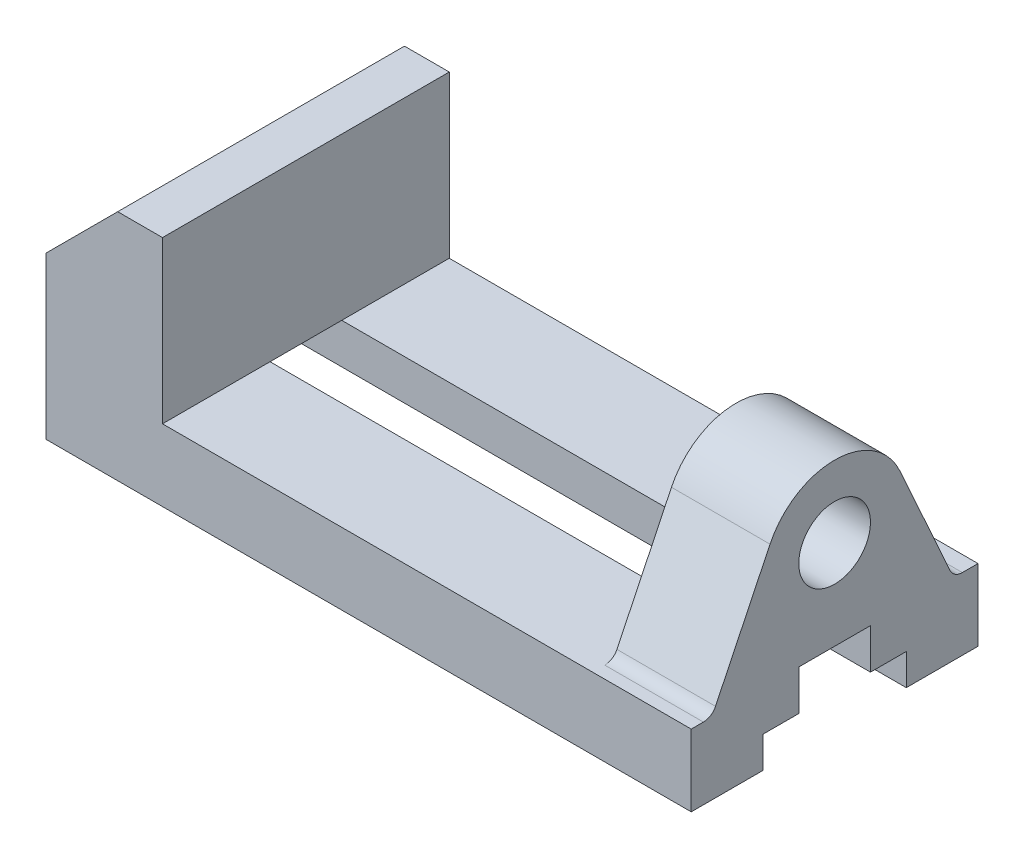
ISO-10303-21;
HEADER;
FILE_DESCRIPTION(('STEP AP214'),'2;1');
FILE_NAME('part.step','',(''),(''),'','','');
FILE_SCHEMA(('AUTOMOTIVE_DESIGN { 1 0 10303 214 1 1 1 1 }'));
ENDSEC;
DATA;
#1=APPLICATION_CONTEXT('core data for automotive mechanical design processes');
#2=APPLICATION_PROTOCOL_DEFINITION('international standard','automotive_design',2000,#1);
#3=PRODUCT_CONTEXT('',#1,'mechanical');
#4=PRODUCT('Part','Part','',(#3));
#5=PRODUCT_RELATED_PRODUCT_CATEGORY('part','',(#4));
#6=PRODUCT_DEFINITION_FORMATION('','',#4);
#7=PRODUCT_DEFINITION_CONTEXT('part definition',#1,'design');
#8=PRODUCT_DEFINITION('design','',#6,#7);
#9=PRODUCT_DEFINITION_SHAPE('','',#8);
#10=(LENGTH_UNIT() NAMED_UNIT(*) SI_UNIT(.MILLI.,.METRE.));
#11=(NAMED_UNIT(*) PLANE_ANGLE_UNIT() SI_UNIT($,.RADIAN.));
#12=(NAMED_UNIT(*) SI_UNIT($,.STERADIAN.) SOLID_ANGLE_UNIT());
#13=UNCERTAINTY_MEASURE_WITH_UNIT(LENGTH_MEASURE(1.E-05),#10,'distance_accuracy_value','');
#14=(GEOMETRIC_REPRESENTATION_CONTEXT(3) GLOBAL_UNCERTAINTY_ASSIGNED_CONTEXT((#13)) GLOBAL_UNIT_ASSIGNED_CONTEXT((#10,
#11,#12)) REPRESENTATION_CONTEXT('',''));
#15=CARTESIAN_POINT('',(0.,0.,0.));
#16=DIRECTION('',(0.,0.,1.));
#17=DIRECTION('',(1.,0.,0.));
#18=AXIS2_PLACEMENT_3D('',#15,#16,#17);
#19=CARTESIAN_POINT('',(0.,16.,0.));
#20=DIRECTION('',(0.,1.,0.));
#21=DIRECTION('',(0.,0.,1.));
#22=AXIS2_PLACEMENT_3D('',#19,#20,#21);
#23=PLANE('',#22);
#24=DIRECTION('',(0.,0.,-1.));
#25=VECTOR('',#24,1.);
#26=CARTESIAN_POINT('',(72.,16.,32.));
#27=LINE('',#26,#25);
#28=CARTESIAN_POINT('',(72.,16.,32.));
#29=VERTEX_POINT('',#28);
#30=CARTESIAN_POINT('',(72.,16.,29.2853607883685));
#31=VERTEX_POINT('',#30);
#32=EDGE_CURVE('E352',#29,#31,#27,.T.);
#33=ORIENTED_EDGE('',*,*,#32,.T.);
#34=DIRECTION('',(1.,0.,0.));
#35=VECTOR('',#34,1.);
#36=CARTESIAN_POINT('',(50.,16.,29.2853607883685));
#37=LINE('',#36,#35);
#38=CARTESIAN_POINT('',(50.,16.,29.2853607883685));
#39=VERTEX_POINT('',#38);
#40=EDGE_CURVE('E396',#31,#39,#37,.F.);
#41=ORIENTED_EDGE('',*,*,#40,.T.);
#42=DIRECTION('',(0.,0.,-1.));
#43=VECTOR('',#42,1.);
#44=CARTESIAN_POINT('',(50.,16.,27.40102070522));
#45=LINE('',#44,#43);
#46=CARTESIAN_POINT('',(50.,16.,8.00000000000001));
#47=VERTEX_POINT('',#46);
#48=EDGE_CURVE('E50',#39,#47,#45,.T.);
#49=ORIENTED_EDGE('',*,*,#48,.T.);
#50=DIRECTION('',(1.,0.,0.));
#51=VECTOR('',#50,1.);
#52=CARTESIAN_POINT('',(-72.001,16.,8.));
#53=LINE('',#52,#51);
#54=CARTESIAN_POINT('',(-46.,16.,8.));
#55=VERTEX_POINT('',#54);
#56=EDGE_CURVE('E313',#55,#47,#53,.T.);
#57=ORIENTED_EDGE('',*,*,#56,.F.);
#58=DIRECTION('',(0.,0.,1.));
#59=VECTOR('',#58,1.);
#60=CARTESIAN_POINT('',(-46.,16.,-32.));
#61=LINE('',#60,#59);
#62=CARTESIAN_POINT('',(-46.,16.,32.));
#63=VERTEX_POINT('',#62);
#64=EDGE_CURVE('E330',#55,#63,#61,.T.);
#65=ORIENTED_EDGE('',*,*,#64,.T.);
#66=DIRECTION('',(1.,0.,0.));
#67=VECTOR('',#66,1.);
#68=CARTESIAN_POINT('',(72.,16.,32.));
#69=LINE('',#68,#67);
#70=EDGE_CURVE('E348',#63,#29,#69,.T.);
#71=ORIENTED_EDGE('',*,*,#70,.T.);
#72=EDGE_LOOP('',(#33,#41,#49,#57,#65,#71));
#73=FACE_BOUND('',#72,.T.);
#74=ADVANCED_FACE('F36',(#73),#23,.T.);
#75=CARTESIAN_POINT('',(0.,0.,0.));
#76=DIRECTION('',(0.,1.,0.));
#77=DIRECTION('',(0.,0.,1.));
#78=AXIS2_PLACEMENT_3D('',#75,#76,#77);
#79=PLANE('',#78);
#80=CARTESIAN_POINT('',(-36.,0.,22.));
#81=DIRECTION('',(0.,-1.,0.));
#82=DIRECTION('',(0.,0.,-1.));
#83=AXIS2_PLACEMENT_3D('',#80,#81,#82);
#84=CIRCLE('',#83,3.12499999999999);
#85=CARTESIAN_POINT('',(-36.,0.,18.875));
#86=VERTEX_POINT('',#85);
#87=EDGE_CURVE('E212',#86,#86,#84,.T.);
#88=ORIENTED_EDGE('',*,*,#87,.F.);
#89=EDGE_LOOP('',(#88));
#90=FACE_BOUND('',#89,.T.);
#91=CARTESIAN_POINT('',(34.,0.,22.));
#92=DIRECTION('',(0.,-1.,0.));
#93=DIRECTION('',(0.,0.,-1.));
#94=AXIS2_PLACEMENT_3D('',#91,#92,#93);
#95=CIRCLE('',#94,3.12499999999999);
#96=CARTESIAN_POINT('',(34.,0.,18.875));
#97=VERTEX_POINT('',#96);
#98=EDGE_CURVE('E211',#97,#97,#95,.T.);
#99=ORIENTED_EDGE('',*,*,#98,.F.);
#100=EDGE_LOOP('',(#99));
#101=FACE_BOUND('',#100,.T.);
#102=DIRECTION('',(0.,0.,1.));
#103=VECTOR('',#102,1.);
#104=CARTESIAN_POINT('',(-72.,0.,32.));
#105=LINE('',#104,#103);
#106=CARTESIAN_POINT('',(-72.,0.,16.));
#107=VERTEX_POINT('',#106);
#108=CARTESIAN_POINT('',(-72.,0.,32.));
#109=VERTEX_POINT('',#108);
#110=EDGE_CURVE('E346',#107,#109,#105,.T.);
#111=ORIENTED_EDGE('',*,*,#110,.F.);
#112=DIRECTION('',(1.,0.,0.));
#113=VECTOR('',#112,1.);
#114=CARTESIAN_POINT('',(-72.001,0.,16.));
#115=LINE('',#114,#113);
#116=CARTESIAN_POINT('',(72.,0.,16.));
#117=VERTEX_POINT('',#116);
#118=EDGE_CURVE('E304',#107,#117,#115,.T.);
#119=ORIENTED_EDGE('',*,*,#118,.T.);
#120=DIRECTION('',(0.,0.,-1.));
#121=VECTOR('',#120,1.);
#122=CARTESIAN_POINT('',(72.,0.,32.));
#123=LINE('',#122,#121);
#124=CARTESIAN_POINT('',(72.,0.,32.));
#125=VERTEX_POINT('',#124);
#126=EDGE_CURVE('E364',#125,#117,#123,.T.);
#127=ORIENTED_EDGE('',*,*,#126,.F.);
#128=DIRECTION('',(1.,0.,0.));
#129=VECTOR('',#128,1.);
#130=CARTESIAN_POINT('',(72.,0.,32.));
#131=LINE('',#130,#129);
#132=EDGE_CURVE('E361',#109,#125,#131,.T.);
#133=ORIENTED_EDGE('',*,*,#132,.F.);
#134=EDGE_LOOP('',(#111,#119,#127,#133));
#135=FACE_BOUND('',#134,.T.);
#136=ADVANCED_FACE('F468',(#90,#101,#135),#79,.F.);
#137=CARTESIAN_POINT('',(50.,16.,-8.));
#138=VERTEX_POINT('',#137);
#139=CARTESIAN_POINT('',(50.,16.,-28.5055448882984));
#140=VERTEX_POINT('',#139);
#141=EDGE_CURVE('E248',#138,#140,#45,.T.);
#142=ORIENTED_EDGE('',*,*,#141,.T.);
#143=DIRECTION('',(1.,0.,0.));
#144=VECTOR('',#143,1.);
#145=CARTESIAN_POINT('',(72.,16.,-28.5055448882984));
#146=LINE('',#145,#144);
#147=CARTESIAN_POINT('',(72.,16.,-28.5055448882984));
#148=VERTEX_POINT('',#147);
#149=EDGE_CURVE('E388',#140,#148,#146,.T.);
#150=ORIENTED_EDGE('',*,*,#149,.T.);
#151=CARTESIAN_POINT('',(72.,16.,-32.));
#152=VERTEX_POINT('',#151);
#153=EDGE_CURVE('E350',#148,#152,#27,.T.);
#154=ORIENTED_EDGE('',*,*,#153,.T.);
#155=DIRECTION('',(-1.,0.,0.));
#156=VECTOR('',#155,1.);
#157=CARTESIAN_POINT('',(72.,16.,-32.));
#158=LINE('',#157,#156);
#159=CARTESIAN_POINT('',(-46.,16.,-32.));
#160=VERTEX_POINT('',#159);
#161=EDGE_CURVE('E354',#152,#160,#158,.T.);
#162=ORIENTED_EDGE('',*,*,#161,.T.);
#163=CARTESIAN_POINT('',(-46.,16.,-8.));
#164=VERTEX_POINT('',#163);
#165=EDGE_CURVE('E335',#160,#164,#61,.T.);
#166=ORIENTED_EDGE('',*,*,#165,.T.);
#167=DIRECTION('',(1.,0.,0.));
#168=VECTOR('',#167,1.);
#169=CARTESIAN_POINT('',(-72.001,16.,-8.));
#170=LINE('',#169,#168);
#171=EDGE_CURVE('E317',#164,#138,#170,.T.);
#172=ORIENTED_EDGE('',*,*,#171,.T.);
#173=EDGE_LOOP('',(#142,#150,#154,#162,#166,#172));
#174=FACE_BOUND('',#173,.T.);
#175=ADVANCED_FACE('F414',(#174),#23,.T.);
#176=CARTESIAN_POINT('',(-72.,16.,32.));
#177=DIRECTION('',(1.,0.,0.));
#178=DIRECTION('',(0.,0.,-1.));
#179=AXIS2_PLACEMENT_3D('',#176,#177,#178);
#180=PLANE('',#179);
#181=DIRECTION('',(0.,0.,-1.));
#182=VECTOR('',#181,1.);
#183=CARTESIAN_POINT('',(-72.,7.,16.));
#184=LINE('',#183,#182);
#185=CARTESIAN_POINT('',(-72.,7.,16.));
#186=VERTEX_POINT('',#185);
#187=CARTESIAN_POINT('',(-72.,7.,8.));
#188=VERTEX_POINT('',#187);
#189=EDGE_CURVE('E281',#186,#188,#184,.T.);
#190=ORIENTED_EDGE('',*,*,#189,.F.);
#191=DIRECTION('',(0.,1.,0.));
#192=VECTOR('',#191,1.);
#193=CARTESIAN_POINT('',(-72.,0.,16.));
#194=LINE('',#193,#192);
#195=EDGE_CURVE('E284',#107,#186,#194,.T.);
#196=ORIENTED_EDGE('',*,*,#195,.F.);
#197=ORIENTED_EDGE('',*,*,#110,.T.);
#198=DIRECTION('',(0.,-1.,0.));
#199=VECTOR('',#198,1.);
#200=CARTESIAN_POINT('',(-72.,16.,32.));
#201=LINE('',#200,#199);
#202=CARTESIAN_POINT('',(-72.,36.,32.));
#203=VERTEX_POINT('',#202);
#204=EDGE_CURVE('E376',#203,#109,#201,.T.);
#205=ORIENTED_EDGE('',*,*,#204,.F.);
#206=DIRECTION('',(0.,0.,-1.));
#207=VECTOR('',#206,1.);
#208=CARTESIAN_POINT('',(-72.,36.,32.));
#209=LINE('',#208,#207);
#210=CARTESIAN_POINT('',(-72.,36.,-32.));
#211=VERTEX_POINT('',#210);
#212=EDGE_CURVE('E379',#203,#211,#209,.T.);
#213=ORIENTED_EDGE('',*,*,#212,.T.);
#214=DIRECTION('',(0.,-1.,0.));
#215=VECTOR('',#214,1.);
#216=CARTESIAN_POINT('',(-72.,16.,-32.));
#217=LINE('',#216,#215);
#218=CARTESIAN_POINT('',(-72.,0.,-32.));
#219=VERTEX_POINT('',#218);
#220=EDGE_CURVE('E357',#211,#219,#217,.T.);
#221=ORIENTED_EDGE('',*,*,#220,.T.);
#222=CARTESIAN_POINT('',(-72.,0.,-16.));
#223=VERTEX_POINT('',#222);
#224=EDGE_CURVE('E358',#219,#223,#105,.T.);
#225=ORIENTED_EDGE('',*,*,#224,.T.);
#226=DIRECTION('',(0.,-1.,0.));
#227=VECTOR('',#226,1.);
#228=CARTESIAN_POINT('',(-72.,0.,-16.));
#229=LINE('',#228,#227);
#230=CARTESIAN_POINT('',(-72.,7.,-16.));
#231=VERTEX_POINT('',#230);
#232=EDGE_CURVE('E307',#231,#223,#229,.T.);
#233=ORIENTED_EDGE('',*,*,#232,.F.);
#234=DIRECTION('',(0.,0.,-1.));
#235=VECTOR('',#234,1.);
#236=CARTESIAN_POINT('',(-72.,7.,-16.));
#237=LINE('',#236,#235);
#238=CARTESIAN_POINT('',(-72.,7.,-8.));
#239=VERTEX_POINT('',#238);
#240=EDGE_CURVE('E269',#239,#231,#237,.T.);
#241=ORIENTED_EDGE('',*,*,#240,.F.);
#242=DIRECTION('',(0.,-1.,0.));
#243=VECTOR('',#242,1.);
#244=CARTESIAN_POINT('',(-72.,7.,-8.));
#245=LINE('',#244,#243);
#246=CARTESIAN_POINT('',(-72.,16.,-8.));
#247=VERTEX_POINT('',#246);
#248=EDGE_CURVE('E272',#247,#239,#245,.T.);
#249=ORIENTED_EDGE('',*,*,#248,.F.);
#250=DIRECTION('',(0.,0.,-1.));
#251=VECTOR('',#250,1.);
#252=CARTESIAN_POINT('',(-72.,16.,8.));
#253=LINE('',#252,#251);
#254=CARTESIAN_POINT('',(-72.,16.,8.));
#255=VERTEX_POINT('',#254);
#256=EDGE_CURVE('E275',#255,#247,#253,.T.);
#257=ORIENTED_EDGE('',*,*,#256,.F.);
#258=DIRECTION('',(0.,1.,0.));
#259=VECTOR('',#258,1.);
#260=CARTESIAN_POINT('',(-72.,7.,8.));
#261=LINE('',#260,#259);
#262=EDGE_CURVE('E278',#188,#255,#261,.T.);
#263=ORIENTED_EDGE('',*,*,#262,.F.);
#264=EDGE_LOOP('',(#190,#196,#197,#205,#213,#221,#225,#233,#241,#249,#257,#263));
#265=FACE_BOUND('',#264,.T.);
#266=ADVANCED_FACE('F478',(#265),#180,.F.);
#267=CARTESIAN_POINT('',(72.,16.,32.));
#268=DIRECTION('',(0.,0.,-1.));
#269=DIRECTION('',(-1.,0.,0.));
#270=AXIS2_PLACEMENT_3D('',#267,#268,#269);
#271=PLANE('',#270);
#272=DIRECTION('',(-1.,0.,0.));
#273=VECTOR('',#272,1.);
#274=CARTESIAN_POINT('',(-46.,52.,32.));
#275=LINE('',#274,#273);
#276=CARTESIAN_POINT('',(-46.,52.,32.));
#277=VERTEX_POINT('',#276);
#278=CARTESIAN_POINT('',(-55.9999999999999,52.,32.));
#279=VERTEX_POINT('',#278);
#280=EDGE_CURVE('E331',#277,#279,#275,.T.);
#281=ORIENTED_EDGE('',*,*,#280,.T.);
#282=DIRECTION('',(0.707106781186548,0.707106781186548,0.));
#283=VECTOR('',#282,1.);
#284=CARTESIAN_POINT('',(-72.,36.,32.));
#285=LINE('',#284,#283);
#286=EDGE_CURVE('E386',#279,#203,#285,.F.);
#287=ORIENTED_EDGE('',*,*,#286,.T.);
#288=ORIENTED_EDGE('',*,*,#204,.T.);
#289=ORIENTED_EDGE('',*,*,#132,.T.);
#290=DIRECTION('',(0.,-1.,0.));
#291=VECTOR('',#290,1.);
#292=CARTESIAN_POINT('',(72.,16.,32.));
#293=LINE('',#292,#291);
#294=EDGE_CURVE('E373',#29,#125,#293,.T.);
#295=ORIENTED_EDGE('',*,*,#294,.F.);
#296=ORIENTED_EDGE('',*,*,#70,.F.);
#297=DIRECTION('',(0.,-1.,0.));
#298=VECTOR('',#297,1.);
#299=CARTESIAN_POINT('',(-46.,52.,32.));
#300=LINE('',#299,#298);
#301=EDGE_CURVE('E343',#277,#63,#300,.T.);
#302=ORIENTED_EDGE('',*,*,#301,.F.);
#303=EDGE_LOOP('',(#281,#287,#288,#289,#295,#296,#302));
#304=FACE_BOUND('',#303,.T.);
#305=ADVANCED_FACE('F482',(#304),#271,.F.);
#306=CARTESIAN_POINT('',(72.,16.,32.));
#307=DIRECTION('',(-1.,0.,0.));
#308=DIRECTION('',(0.,0.,1.));
#309=AXIS2_PLACEMENT_3D('',#306,#307,#308);
#310=PLANE('',#309);
#311=ORIENTED_EDGE('',*,*,#153,.F.);
#312=CARTESIAN_POINT('',(72.,19.,-28.5055448882984));
#313=DIRECTION('',(-1.,0.,0.));
#314=DIRECTION('',(0.,0.,1.));
#315=AXIS2_PLACEMENT_3D('',#312,#313,#314);
#316=CIRCLE('',#315,3.);
#317=CARTESIAN_POINT('',(72.,17.7670339470634,-25.7706235526279));
#318=VERTEX_POINT('',#317);
#319=EDGE_CURVE('E398',#148,#318,#316,.T.);
#320=ORIENTED_EDGE('',*,*,#319,.T.);
#321=DIRECTION('',(0.,0.911640445223516,0.410988684312195));
#322=VECTOR('',#321,1.);
#323=CARTESIAN_POINT('',(72.,42.5758189489951,-14.5862471235763));
#324=LINE('',#323,#322);
#325=CARTESIAN_POINT('',(72.,42.5758189489951,-14.5862471235763));
#326=VERTEX_POINT('',#325);
#327=EDGE_CURVE('E245',#318,#326,#324,.T.);
#328=ORIENTED_EDGE('',*,*,#327,.T.);
#329=CARTESIAN_POINT('',(72.,36.,0.));
#330=DIRECTION('',(1.,0.,0.));
#331=DIRECTION('',(0.,0.,-1.));
#332=AXIS2_PLACEMENT_3D('',#329,#330,#331);
#333=CIRCLE('',#332,16.);
#334=CARTESIAN_POINT('',(72.,42.9468586110198,14.4132284876949));
#335=VERTEX_POINT('',#334);
#336=EDGE_CURVE('E238',#326,#335,#333,.T.);
#337=ORIENTED_EDGE('',*,*,#336,.T.);
#338=DIRECTION('',(0.,-0.900826780480933,0.434178663188736));
#339=VECTOR('',#338,1.);
#340=CARTESIAN_POINT('',(72.,42.9468586110198,14.4132284876949));
#341=LINE('',#340,#339);
#342=CARTESIAN_POINT('',(72.,17.6974640104338,26.5828804469257));
#343=VERTEX_POINT('',#342);
#344=EDGE_CURVE('E256',#335,#343,#341,.T.);
#345=ORIENTED_EDGE('',*,*,#344,.T.);
#346=CARTESIAN_POINT('',(72.,19.,29.2853607883685));
#347=DIRECTION('',(-1.,0.,0.));
#348=DIRECTION('',(0.,0.,1.));
#349=AXIS2_PLACEMENT_3D('',#346,#347,#348);
#350=CIRCLE('',#349,3.);
#351=EDGE_CURVE('E44',#343,#31,#350,.T.);
#352=ORIENTED_EDGE('',*,*,#351,.T.);
#353=ORIENTED_EDGE('',*,*,#32,.F.);
#354=ORIENTED_EDGE('',*,*,#294,.T.);
#355=ORIENTED_EDGE('',*,*,#126,.T.);
#356=DIRECTION('',(0.,-1.,0.));
#357=VECTOR('',#356,1.);
#358=CARTESIAN_POINT('',(72.,0.,16.));
#359=LINE('',#358,#357);
#360=CARTESIAN_POINT('',(72.,7.,16.));
#361=VERTEX_POINT('',#360);
#362=EDGE_CURVE('E301',#361,#117,#359,.T.);
#363=ORIENTED_EDGE('',*,*,#362,.F.);
#364=DIRECTION('',(0.,0.,1.));
#365=VECTOR('',#364,1.);
#366=CARTESIAN_POINT('',(72.,7.,16.));
#367=LINE('',#366,#365);
#368=CARTESIAN_POINT('',(72.,7.,8.));
#369=VERTEX_POINT('',#368);
#370=EDGE_CURVE('E298',#369,#361,#367,.T.);
#371=ORIENTED_EDGE('',*,*,#370,.F.);
#372=DIRECTION('',(0.,-1.,0.));
#373=VECTOR('',#372,1.);
#374=CARTESIAN_POINT('',(72.,7.,8.));
#375=LINE('',#374,#373);
#376=CARTESIAN_POINT('',(72.,16.,8.));
#377=VERTEX_POINT('',#376);
#378=EDGE_CURVE('E295',#377,#369,#375,.T.);
#379=ORIENTED_EDGE('',*,*,#378,.F.);
#380=DIRECTION('',(0.,0.,-1.));
#381=VECTOR('',#380,1.);
#382=CARTESIAN_POINT('',(72.,16.,27.40102070522));
#383=LINE('',#382,#381);
#384=CARTESIAN_POINT('',(72.,16.,-7.99999999999999));
#385=VERTEX_POINT('',#384);
#386=EDGE_CURVE('E258',#377,#385,#383,.T.);
#387=ORIENTED_EDGE('',*,*,#386,.T.);
#388=DIRECTION('',(0.,1.,0.));
#389=VECTOR('',#388,1.);
#390=CARTESIAN_POINT('',(72.,7.,-8.));
#391=LINE('',#390,#389);
#392=CARTESIAN_POINT('',(72.,7.,-8.));
#393=VERTEX_POINT('',#392);
#394=EDGE_CURVE('E293',#393,#385,#391,.T.);
#395=ORIENTED_EDGE('',*,*,#394,.F.);
#396=DIRECTION('',(0.,0.,1.));
#397=VECTOR('',#396,1.);
#398=CARTESIAN_POINT('',(72.,7.,-16.));
#399=LINE('',#398,#397);
#400=CARTESIAN_POINT('',(72.,7.,-16.));
#401=VERTEX_POINT('',#400);
#402=EDGE_CURVE('E290',#401,#393,#399,.T.);
#403=ORIENTED_EDGE('',*,*,#402,.F.);
#404=DIRECTION('',(0.,1.,0.));
#405=VECTOR('',#404,1.);
#406=CARTESIAN_POINT('',(72.,0.,-16.));
#407=LINE('',#406,#405);
#408=CARTESIAN_POINT('',(72.,0.,-16.));
#409=VERTEX_POINT('',#408);
#410=EDGE_CURVE('E287',#409,#401,#407,.T.);
#411=ORIENTED_EDGE('',*,*,#410,.F.);
#412=CARTESIAN_POINT('',(72.,0.,-32.));
#413=VERTEX_POINT('',#412);
#414=EDGE_CURVE('E363',#409,#413,#123,.T.);
#415=ORIENTED_EDGE('',*,*,#414,.T.);
#416=DIRECTION('',(0.,-1.,0.));
#417=VECTOR('',#416,1.);
#418=CARTESIAN_POINT('',(72.,16.,-32.));
#419=LINE('',#418,#417);
#420=EDGE_CURVE('E370',#152,#413,#419,.T.);
#421=ORIENTED_EDGE('',*,*,#420,.F.);
#422=EDGE_LOOP('',(#311,#320,#328,#337,#345,#352,#353,#354,#355,#363,#371,#379,#387,#395,#403,
#411,#415,#421));
#423=FACE_BOUND('',#422,.T.);
#424=CARTESIAN_POINT('',(72.,36.,0.));
#425=DIRECTION('',(1.,0.,0.));
#426=DIRECTION('',(0.,0.,-1.));
#427=AXIS2_PLACEMENT_3D('',#424,#425,#426);
#428=CIRCLE('',#427,8.);
#429=CARTESIAN_POINT('',(72.,36.,-8.));
#430=VERTEX_POINT('',#429);
#431=EDGE_CURVE('E234',#430,#430,#428,.T.);
#432=ORIENTED_EDGE('',*,*,#431,.F.);
#433=EDGE_LOOP('',(#432));
#434=FACE_BOUND('',#433,.T.);
#435=ADVANCED_FACE('F416',(#423,#434),#310,.F.);
#436=CARTESIAN_POINT('',(72.,16.,-32.));
#437=DIRECTION('',(0.,0.,1.));
#438=DIRECTION('',(1.,0.,0.));
#439=AXIS2_PLACEMENT_3D('',#436,#437,#438);
#440=PLANE('',#439);
#441=ORIENTED_EDGE('',*,*,#220,.F.);
#442=DIRECTION('',(-0.707106781186548,-0.707106781186548,0.));
#443=VECTOR('',#442,1.);
#444=CARTESIAN_POINT('',(-72.,36.,-32.));
#445=LINE('',#444,#443);
#446=CARTESIAN_POINT('',(-55.9999999999999,52.,-32.));
#447=VERTEX_POINT('',#446);
#448=EDGE_CURVE('E382',#211,#447,#445,.F.);
#449=ORIENTED_EDGE('',*,*,#448,.T.);
#450=DIRECTION('',(1.,0.,0.));
#451=VECTOR('',#450,1.);
#452=CARTESIAN_POINT('',(-72.,52.,-32.));
#453=LINE('',#452,#451);
#454=CARTESIAN_POINT('',(-46.,52.,-32.));
#455=VERTEX_POINT('',#454);
#456=EDGE_CURVE('E334',#447,#455,#453,.T.);
#457=ORIENTED_EDGE('',*,*,#456,.T.);
#458=DIRECTION('',(0.,-1.,0.));
#459=VECTOR('',#458,1.);
#460=CARTESIAN_POINT('',(-46.,52.,-32.));
#461=LINE('',#460,#459);
#462=EDGE_CURVE('E340',#455,#160,#461,.T.);
#463=ORIENTED_EDGE('',*,*,#462,.T.);
#464=ORIENTED_EDGE('',*,*,#161,.F.);
#465=ORIENTED_EDGE('',*,*,#420,.T.);
#466=DIRECTION('',(-1.,0.,0.));
#467=VECTOR('',#466,1.);
#468=CARTESIAN_POINT('',(72.,0.,-32.));
#469=LINE('',#468,#467);
#470=EDGE_CURVE('E351',#413,#219,#469,.T.);
#471=ORIENTED_EDGE('',*,*,#470,.T.);
#472=EDGE_LOOP('',(#441,#449,#457,#463,#464,#465,#471));
#473=FACE_BOUND('',#472,.T.);
#474=ADVANCED_FACE('F425',(#473),#440,.F.);
#475=CARTESIAN_POINT('',(-36.,0.,-22.));
#476=DIRECTION('',(0.,-1.,0.));
#477=DIRECTION('',(0.,0.,-1.));
#478=AXIS2_PLACEMENT_3D('',#475,#476,#477);
#479=CIRCLE('',#478,3.12499999999999);
#480=CARTESIAN_POINT('',(-36.,0.,-25.125));
#481=VERTEX_POINT('',#480);
#482=EDGE_CURVE('E222',#481,#481,#479,.T.);
#483=ORIENTED_EDGE('',*,*,#482,.F.);
#484=EDGE_LOOP('',(#483));
#485=FACE_BOUND('',#484,.T.);
#486=CARTESIAN_POINT('',(34.,0.,-22.));
#487=DIRECTION('',(0.,-1.,0.));
#488=DIRECTION('',(0.,0.,-1.));
#489=AXIS2_PLACEMENT_3D('',#486,#487,#488);
#490=CIRCLE('',#489,3.12499999999999);
#491=CARTESIAN_POINT('',(34.,0.,-25.125));
#492=VERTEX_POINT('',#491);
#493=EDGE_CURVE('E228',#492,#492,#490,.T.);
#494=ORIENTED_EDGE('',*,*,#493,.F.);
#495=EDGE_LOOP('',(#494));
#496=FACE_BOUND('',#495,.T.);
#497=ORIENTED_EDGE('',*,*,#414,.F.);
#498=DIRECTION('',(1.,0.,0.));
#499=VECTOR('',#498,1.);
#500=CARTESIAN_POINT('',(-72.001,0.,-16.));
#501=LINE('',#500,#499);
#502=EDGE_CURVE('E303',#223,#409,#501,.T.);
#503=ORIENTED_EDGE('',*,*,#502,.F.);
#504=ORIENTED_EDGE('',*,*,#224,.F.);
#505=ORIENTED_EDGE('',*,*,#470,.F.);
#506=EDGE_LOOP('',(#497,#503,#504,#505));
#507=FACE_BOUND('',#506,.T.);
#508=ADVANCED_FACE('F475',(#485,#496,#507),#79,.F.);
#509=CARTESIAN_POINT('',(-46.,52.,-32.));
#510=DIRECTION('',(1.,0.,0.));
#511=DIRECTION('',(0.,0.,-1.));
#512=AXIS2_PLACEMENT_3D('',#509,#510,#511);
#513=PLANE('',#512);
#514=ORIENTED_EDGE('',*,*,#165,.F.);
#515=ORIENTED_EDGE('',*,*,#462,.F.);
#516=DIRECTION('',(0.,0.,1.));
#517=VECTOR('',#516,1.);
#518=CARTESIAN_POINT('',(-46.,52.,-32.));
#519=LINE('',#518,#517);
#520=EDGE_CURVE('E337',#455,#277,#519,.T.);
#521=ORIENTED_EDGE('',*,*,#520,.T.);
#522=ORIENTED_EDGE('',*,*,#301,.T.);
#523=ORIENTED_EDGE('',*,*,#64,.F.);
#524=DIRECTION('',(0.,0.,-1.));
#525=VECTOR('',#524,1.);
#526=CARTESIAN_POINT('',(-46.,16.,8.));
#527=LINE('',#526,#525);
#528=EDGE_CURVE('E327',#55,#164,#527,.T.);
#529=ORIENTED_EDGE('',*,*,#528,.T.);
#530=EDGE_LOOP('',(#514,#515,#521,#522,#523,#529));
#531=FACE_BOUND('',#530,.T.);
#532=ADVANCED_FACE('F430',(#531),#513,.T.);
#533=CARTESIAN_POINT('',(0.,52.,0.));
#534=DIRECTION('',(0.,-1.,0.));
#535=DIRECTION('',(0.,0.,-1.));
#536=AXIS2_PLACEMENT_3D('',#533,#534,#535);
#537=PLANE('',#536);
#538=ORIENTED_EDGE('',*,*,#456,.F.);
#539=DIRECTION('',(0.,0.,1.));
#540=VECTOR('',#539,1.);
#541=CARTESIAN_POINT('',(-55.9999999999999,52.,0.));
#542=LINE('',#541,#540);
#543=EDGE_CURVE('E384',#447,#279,#542,.T.);
#544=ORIENTED_EDGE('',*,*,#543,.T.);
#545=ORIENTED_EDGE('',*,*,#280,.F.);
#546=ORIENTED_EDGE('',*,*,#520,.F.);
#547=EDGE_LOOP('',(#538,#544,#545,#546));
#548=FACE_BOUND('',#547,.T.);
#549=ADVANCED_FACE('F496',(#548),#537,.F.);
#550=CARTESIAN_POINT('',(-72.,36.,32.));
#551=DIRECTION('',(0.707106781186548,-0.707106781186548,0.));
#552=DIRECTION('',(0.,0.,-1.));
#553=AXIS2_PLACEMENT_3D('',#550,#551,#552);
#554=PLANE('',#553);
#555=ORIENTED_EDGE('',*,*,#286,.F.);
#556=ORIENTED_EDGE('',*,*,#543,.F.);
#557=ORIENTED_EDGE('',*,*,#448,.F.);
#558=ORIENTED_EDGE('',*,*,#212,.F.);
#559=EDGE_LOOP('',(#555,#556,#557,#558));
#560=FACE_BOUND('',#559,.T.);
#561=ADVANCED_FACE('F493',(#560),#554,.F.);
#562=CARTESIAN_POINT('',(-72.001,0.,16.));
#563=DIRECTION('',(0.,0.,1.));
#564=DIRECTION('',(1.,0.,0.));
#565=AXIS2_PLACEMENT_3D('',#562,#563,#564);
#566=PLANE('',#565);
#567=ORIENTED_EDGE('',*,*,#195,.T.);
#568=DIRECTION('',(1.,0.,0.));
#569=VECTOR('',#568,1.);
#570=CARTESIAN_POINT('',(-72.001,7.,16.));
#571=LINE('',#570,#569);
#572=EDGE_CURVE('E308',#186,#361,#571,.T.);
#573=ORIENTED_EDGE('',*,*,#572,.T.);
#574=ORIENTED_EDGE('',*,*,#362,.T.);
#575=ORIENTED_EDGE('',*,*,#118,.F.);
#576=EDGE_LOOP('',(#567,#573,#574,#575));
#577=FACE_BOUND('',#576,.T.);
#578=ADVANCED_FACE('F495',(#577),#566,.F.);
#579=CARTESIAN_POINT('',(-72.001,7.,16.));
#580=DIRECTION('',(0.,1.,0.));
#581=DIRECTION('',(0.,0.,1.));
#582=AXIS2_PLACEMENT_3D('',#579,#580,#581);
#583=PLANE('',#582);
#584=ORIENTED_EDGE('',*,*,#189,.T.);
#585=DIRECTION('',(1.,0.,0.));
#586=VECTOR('',#585,1.);
#587=CARTESIAN_POINT('',(-72.001,7.,8.));
#588=LINE('',#587,#586);
#589=EDGE_CURVE('E310',#188,#369,#588,.T.);
#590=ORIENTED_EDGE('',*,*,#589,.T.);
#591=ORIENTED_EDGE('',*,*,#370,.T.);
#592=ORIENTED_EDGE('',*,*,#572,.F.);
#593=EDGE_LOOP('',(#584,#590,#591,#592));
#594=FACE_BOUND('',#593,.T.);
#595=ADVANCED_FACE('F570',(#594),#583,.F.);
#596=CARTESIAN_POINT('',(-72.001,7.,8.));
#597=DIRECTION('',(0.,0.,1.));
#598=DIRECTION('',(1.,0.,0.));
#599=AXIS2_PLACEMENT_3D('',#596,#597,#598);
#600=PLANE('',#599);
#601=ORIENTED_EDGE('',*,*,#262,.T.);
#602=EDGE_CURVE('E312',#255,#55,#53,.T.);
#603=ORIENTED_EDGE('',*,*,#602,.T.);
#604=ORIENTED_EDGE('',*,*,#56,.T.);
#605=DIRECTION('',(1.,0.,0.));
#606=VECTOR('',#605,1.);
#607=CARTESIAN_POINT('',(-72.001,16.,8.));
#608=LINE('',#607,#606);
#609=EDGE_CURVE('E265',#47,#377,#608,.T.);
#610=ORIENTED_EDGE('',*,*,#609,.T.);
#611=ORIENTED_EDGE('',*,*,#378,.T.);
#612=ORIENTED_EDGE('',*,*,#589,.F.);
#613=EDGE_LOOP('',(#601,#603,#604,#610,#611,#612));
#614=FACE_BOUND('',#613,.T.);
#615=ADVANCED_FACE('F438',(#614),#600,.F.);
#616=CARTESIAN_POINT('',(-72.001,16.,8.));
#617=DIRECTION('',(0.,1.,0.));
#618=DIRECTION('',(0.,0.,1.));
#619=AXIS2_PLACEMENT_3D('',#616,#617,#618);
#620=PLANE('',#619);
#621=ORIENTED_EDGE('',*,*,#256,.T.);
#622=EDGE_CURVE('E316',#247,#164,#170,.T.);
#623=ORIENTED_EDGE('',*,*,#622,.T.);
#624=ORIENTED_EDGE('',*,*,#528,.F.);
#625=ORIENTED_EDGE('',*,*,#602,.F.);
#626=EDGE_LOOP('',(#621,#623,#624,#625));
#627=FACE_BOUND('',#626,.T.);
#628=ADVANCED_FACE('F435',(#627),#620,.F.);
#629=CARTESIAN_POINT('',(-72.001,7.,-8.));
#630=DIRECTION('',(0.,0.,-1.));
#631=DIRECTION('',(-1.,0.,0.));
#632=AXIS2_PLACEMENT_3D('',#629,#630,#631);
#633=PLANE('',#632);
#634=ORIENTED_EDGE('',*,*,#248,.T.);
#635=DIRECTION('',(1.,0.,0.));
#636=VECTOR('',#635,1.);
#637=CARTESIAN_POINT('',(-72.001,7.,-8.));
#638=LINE('',#637,#636);
#639=EDGE_CURVE('E321',#239,#393,#638,.T.);
#640=ORIENTED_EDGE('',*,*,#639,.T.);
#641=ORIENTED_EDGE('',*,*,#394,.T.);
#642=EDGE_CURVE('E320',#138,#385,#170,.T.);
#643=ORIENTED_EDGE('',*,*,#642,.F.);
#644=ORIENTED_EDGE('',*,*,#171,.F.);
#645=ORIENTED_EDGE('',*,*,#622,.F.);
#646=EDGE_LOOP('',(#634,#640,#641,#643,#644,#645));
#647=FACE_BOUND('',#646,.T.);
#648=ADVANCED_FACE('F568',(#647),#633,.F.);
#649=CARTESIAN_POINT('',(-72.001,7.,-16.));
#650=DIRECTION('',(0.,1.,0.));
#651=DIRECTION('',(0.,0.,1.));
#652=AXIS2_PLACEMENT_3D('',#649,#650,#651);
#653=PLANE('',#652);
#654=ORIENTED_EDGE('',*,*,#240,.T.);
#655=DIRECTION('',(1.,0.,0.));
#656=VECTOR('',#655,1.);
#657=CARTESIAN_POINT('',(-72.001,7.,-16.));
#658=LINE('',#657,#656);
#659=EDGE_CURVE('E323',#231,#401,#658,.T.);
#660=ORIENTED_EDGE('',*,*,#659,.T.);
#661=ORIENTED_EDGE('',*,*,#402,.T.);
#662=ORIENTED_EDGE('',*,*,#639,.F.);
#663=EDGE_LOOP('',(#654,#660,#661,#662));
#664=FACE_BOUND('',#663,.T.);
#665=ADVANCED_FACE('F565',(#664),#653,.F.);
#666=CARTESIAN_POINT('',(-72.001,0.,-16.));
#667=DIRECTION('',(0.,0.,-1.));
#668=DIRECTION('',(-1.,0.,0.));
#669=AXIS2_PLACEMENT_3D('',#666,#667,#668);
#670=PLANE('',#669);
#671=ORIENTED_EDGE('',*,*,#232,.T.);
#672=ORIENTED_EDGE('',*,*,#502,.T.);
#673=ORIENTED_EDGE('',*,*,#410,.T.);
#674=ORIENTED_EDGE('',*,*,#659,.F.);
#675=EDGE_LOOP('',(#671,#672,#673,#674));
#676=FACE_BOUND('',#675,.T.);
#677=ADVANCED_FACE('F562',(#676),#670,.F.);
#678=CARTESIAN_POINT('',(50.,16.,27.40102070522));
#679=DIRECTION('',(0.,-1.,0.));
#680=DIRECTION('',(0.,0.,-1.));
#681=AXIS2_PLACEMENT_3D('',#678,#679,#680);
#682=PLANE('',#681);
#683=ORIENTED_EDGE('',*,*,#609,.F.);
#684=EDGE_CURVE('E251',#47,#138,#45,.T.);
#685=ORIENTED_EDGE('',*,*,#684,.T.);
#686=ORIENTED_EDGE('',*,*,#642,.T.);
#687=ORIENTED_EDGE('',*,*,#386,.F.);
#688=EDGE_LOOP('',(#683,#685,#686,#687));
#689=FACE_BOUND('',#688,.T.);
#690=ADVANCED_FACE('F463',(#689),#682,.T.);
#691=CARTESIAN_POINT('',(50.,36.,0.));
#692=DIRECTION('',(1.,0.,0.));
#693=DIRECTION('',(0.,0.,-1.));
#694=AXIS2_PLACEMENT_3D('',#691,#692,#693);
#695=CYLINDRICAL_SURFACE('',#694,16.);
#696=ORIENTED_EDGE('',*,*,#336,.F.);
#697=DIRECTION('',(1.,0.,0.));
#698=VECTOR('',#697,1.);
#699=CARTESIAN_POINT('',(50.,42.5758189489951,-14.5862471235763));
#700=LINE('',#699,#698);
#701=CARTESIAN_POINT('',(50.,42.5758189489951,-14.5862471235763));
#702=VERTEX_POINT('',#701);
#703=EDGE_CURVE('E262',#702,#326,#700,.T.);
#704=ORIENTED_EDGE('',*,*,#703,.F.);
#705=CARTESIAN_POINT('',(50.,36.,0.));
#706=DIRECTION('',(1.,0.,0.));
#707=DIRECTION('',(0.,0.,-1.));
#708=AXIS2_PLACEMENT_3D('',#705,#706,#707);
#709=CIRCLE('',#708,16.);
#710=CARTESIAN_POINT('',(50.,42.9468586110198,14.4132284876949));
#711=VERTEX_POINT('',#710);
#712=EDGE_CURVE('E241',#702,#711,#709,.T.);
#713=ORIENTED_EDGE('',*,*,#712,.T.);
#714=DIRECTION('',(1.,0.,0.));
#715=VECTOR('',#714,1.);
#716=CARTESIAN_POINT('',(50.,42.9468586110198,14.4132284876949));
#717=LINE('',#716,#715);
#718=EDGE_CURVE('E253',#711,#335,#717,.T.);
#719=ORIENTED_EDGE('',*,*,#718,.T.);
#720=EDGE_LOOP('',(#696,#704,#713,#719));
#721=FACE_BOUND('',#720,.T.);
#722=ADVANCED_FACE('F452',(#721),#695,.T.);
#723=CARTESIAN_POINT('',(50.,42.5758189489951,-14.5862471235763));
#724=DIRECTION('',(0.,0.410988684312195,-0.911640445223516));
#725=DIRECTION('',(0.,0.911640445223516,0.410988684312195));
#726=AXIS2_PLACEMENT_3D('',#723,#724,#725);
#727=PLANE('',#726);
#728=ORIENTED_EDGE('',*,*,#327,.F.);
#729=DIRECTION('',(1.,0.,0.));
#730=VECTOR('',#729,1.);
#731=CARTESIAN_POINT('',(50.,17.7670339470634,-25.7706235526279));
#732=LINE('',#731,#730);
#733=CARTESIAN_POINT('',(50.,17.7670339470634,-25.7706235526279));
#734=VERTEX_POINT('',#733);
#735=EDGE_CURVE('E391',#318,#734,#732,.F.);
#736=ORIENTED_EDGE('',*,*,#735,.T.);
#737=DIRECTION('',(0.,0.911640445223516,0.410988684312195));
#738=VECTOR('',#737,1.);
#739=CARTESIAN_POINT('',(50.,42.5758189489951,-14.5862471235763));
#740=LINE('',#739,#738);
#741=EDGE_CURVE('E250',#734,#702,#740,.T.);
#742=ORIENTED_EDGE('',*,*,#741,.T.);
#743=ORIENTED_EDGE('',*,*,#703,.T.);
#744=EDGE_LOOP('',(#728,#736,#742,#743));
#745=FACE_BOUND('',#744,.T.);
#746=ADVANCED_FACE('F455',(#745),#727,.T.);
#747=CARTESIAN_POINT('',(50.,42.9468586110198,14.4132284876949));
#748=DIRECTION('',(0.,0.434178663188736,0.900826780480933));
#749=DIRECTION('',(0.,-0.900826780480933,0.434178663188736));
#750=AXIS2_PLACEMENT_3D('',#747,#748,#749);
#751=PLANE('',#750);
#752=DIRECTION('',(0.,-0.900826780480933,0.434178663188736));
#753=VECTOR('',#752,1.);
#754=CARTESIAN_POINT('',(50.,42.9468586110198,14.4132284876949));
#755=LINE('',#754,#753);
#756=CARTESIAN_POINT('',(50.,17.6974640104338,26.5828804469257));
#757=VERTEX_POINT('',#756);
#758=EDGE_CURVE('E244',#711,#757,#755,.T.);
#759=ORIENTED_EDGE('',*,*,#758,.T.);
#760=DIRECTION('',(1.,0.,0.));
#761=VECTOR('',#760,1.);
#762=CARTESIAN_POINT('',(72.,17.6974640104338,26.5828804469257));
#763=LINE('',#762,#761);
#764=EDGE_CURVE('E393',#757,#343,#763,.T.);
#765=ORIENTED_EDGE('',*,*,#764,.T.);
#766=ORIENTED_EDGE('',*,*,#344,.F.);
#767=ORIENTED_EDGE('',*,*,#718,.F.);
#768=EDGE_LOOP('',(#759,#765,#766,#767));
#769=FACE_BOUND('',#768,.T.);
#770=ADVANCED_FACE('F448',(#769),#751,.T.);
#771=CARTESIAN_POINT('',(50.,36.,0.));
#772=DIRECTION('',(1.,0.,0.));
#773=DIRECTION('',(0.,0.,-1.));
#774=AXIS2_PLACEMENT_3D('',#771,#772,#773);
#775=PLANE('',#774);
#776=CARTESIAN_POINT('',(50.,36.,0.));
#777=DIRECTION('',(1.,0.,0.));
#778=DIRECTION('',(0.,0.,-1.));
#779=AXIS2_PLACEMENT_3D('',#776,#777,#778);
#780=CIRCLE('',#779,8.);
#781=CARTESIAN_POINT('',(50.,36.,-8.));
#782=VERTEX_POINT('',#781);
#783=EDGE_CURVE('E235',#782,#782,#780,.T.);
#784=ORIENTED_EDGE('',*,*,#783,.T.);
#785=EDGE_LOOP('',(#784));
#786=FACE_BOUND('',#785,.T.);
#787=ORIENTED_EDGE('',*,*,#712,.F.);
#788=ORIENTED_EDGE('',*,*,#741,.F.);
#789=CARTESIAN_POINT('',(50.,19.,-28.5055448882984));
#790=DIRECTION('',(1.,0.,0.));
#791=DIRECTION('',(0.,0.,-1.));
#792=AXIS2_PLACEMENT_3D('',#789,#790,#791);
#793=CIRCLE('',#792,3.);
#794=EDGE_CURVE('E400',#734,#140,#793,.T.);
#795=ORIENTED_EDGE('',*,*,#794,.T.);
#796=ORIENTED_EDGE('',*,*,#141,.F.);
#797=ORIENTED_EDGE('',*,*,#684,.F.);
#798=ORIENTED_EDGE('',*,*,#48,.F.);
#799=CARTESIAN_POINT('',(50.,19.,29.2853607883685));
#800=DIRECTION('',(1.,0.,0.));
#801=DIRECTION('',(0.,0.,-1.));
#802=AXIS2_PLACEMENT_3D('',#799,#800,#801);
#803=CIRCLE('',#802,3.);
#804=EDGE_CURVE('E11',#39,#757,#803,.T.);
#805=ORIENTED_EDGE('',*,*,#804,.T.);
#806=ORIENTED_EDGE('',*,*,#758,.F.);
#807=EDGE_LOOP('',(#787,#788,#795,#796,#797,#798,#805,#806));
#808=FACE_BOUND('',#807,.T.);
#809=ADVANCED_FACE('F407',(#786,#808),#775,.F.);
#810=CARTESIAN_POINT('',(50.,36.,0.));
#811=DIRECTION('',(1.,0.,0.));
#812=DIRECTION('',(0.,0.,-1.));
#813=AXIS2_PLACEMENT_3D('',#810,#811,#812);
#814=CYLINDRICAL_SURFACE('',#813,8.);
#815=ORIENTED_EDGE('',*,*,#783,.F.);
#816=EDGE_LOOP('',(#815));
#817=FACE_BOUND('',#816,.T.);
#818=ORIENTED_EDGE('',*,*,#431,.T.);
#819=EDGE_LOOP('',(#818));
#820=FACE_BOUND('',#819,.T.);
#821=ADVANCED_FACE('F499',(#817,#820),#814,.F.);
#822=CARTESIAN_POINT('',(0.,19.,-28.5055448882984));
#823=DIRECTION('',(-1.,0.,0.));
#824=DIRECTION('',(0.,0.,1.));
#825=AXIS2_PLACEMENT_3D('',#822,#823,#824);
#826=CYLINDRICAL_SURFACE('',#825,3.);
#827=ORIENTED_EDGE('',*,*,#794,.F.);
#828=ORIENTED_EDGE('',*,*,#735,.F.);
#829=ORIENTED_EDGE('',*,*,#319,.F.);
#830=ORIENTED_EDGE('',*,*,#149,.F.);
#831=EDGE_LOOP('',(#827,#828,#829,#830));
#832=FACE_BOUND('',#831,.T.);
#833=ADVANCED_FACE('F411',(#832),#826,.F.);
#834=CARTESIAN_POINT('',(50.,19.,29.2853607883685));
#835=DIRECTION('',(-1.,0.,0.));
#836=DIRECTION('',(0.,0.,1.));
#837=AXIS2_PLACEMENT_3D('',#834,#835,#836);
#838=CYLINDRICAL_SURFACE('',#837,3.);
#839=ORIENTED_EDGE('',*,*,#804,.F.);
#840=ORIENTED_EDGE('',*,*,#40,.F.);
#841=ORIENTED_EDGE('',*,*,#351,.F.);
#842=ORIENTED_EDGE('',*,*,#764,.F.);
#843=EDGE_LOOP('',(#839,#840,#841,#842));
#844=FACE_BOUND('',#843,.T.);
#845=ADVANCED_FACE('F38',(#844),#838,.F.);
#846=CARTESIAN_POINT('',(34.,9.99999999999999,-22.));
#847=DIRECTION('',(0.,-1.,0.));
#848=DIRECTION('',(0.,0.,-1.));
#849=AXIS2_PLACEMENT_3D('',#846,#847,#848);
#850=CONICAL_SURFACE('',#849,3.12499999999999,1.02974425867665);
#851=CARTESIAN_POINT('',(34.,11.8776894344611,-22.));
#852=VERTEX_POINT('',#851);
#853=VERTEX_LOOP('',#852);
#854=FACE_BOUND('',#853,.T.);
#855=CARTESIAN_POINT('',(34.,9.99999999999999,-22.));
#856=DIRECTION('',(0.,-1.,0.));
#857=DIRECTION('',(0.,0.,-1.));
#858=AXIS2_PLACEMENT_3D('',#855,#856,#857);
#859=CIRCLE('',#858,3.12499999999999);
#860=CARTESIAN_POINT('',(34.,9.99999999999999,-25.125));
#861=VERTEX_POINT('',#860);
#862=EDGE_CURVE('E231',#861,#861,#859,.T.);
#863=ORIENTED_EDGE('',*,*,#862,.T.);
#864=EDGE_LOOP('',(#863));
#865=FACE_BOUND('',#864,.T.);
#866=ADVANCED_FACE('F504',(#854,#865),#850,.F.);
#867=CARTESIAN_POINT('',(34.,0.,-22.));
#868=DIRECTION('',(0.,-1.,0.));
#869=DIRECTION('',(0.,0.,-1.));
#870=AXIS2_PLACEMENT_3D('',#867,#868,#869);
#871=CYLINDRICAL_SURFACE('',#870,3.12499999999999);
#872=ORIENTED_EDGE('',*,*,#862,.F.);
#873=EDGE_LOOP('',(#872));
#874=FACE_BOUND('',#873,.T.);
#875=ORIENTED_EDGE('',*,*,#493,.T.);
#876=EDGE_LOOP('',(#875));
#877=FACE_BOUND('',#876,.T.);
#878=ADVANCED_FACE('F516',(#874,#877),#871,.F.);
#879=CARTESIAN_POINT('',(-36.,9.99999999999999,-22.));
#880=DIRECTION('',(0.,-1.,0.));
#881=DIRECTION('',(0.,0.,-1.));
#882=AXIS2_PLACEMENT_3D('',#879,#880,#881);
#883=CONICAL_SURFACE('',#882,3.12499999999999,1.02974425867665);
#884=CARTESIAN_POINT('',(-36.,11.8776894344611,-22.));
#885=VERTEX_POINT('',#884);
#886=VERTEX_LOOP('',#885);
#887=FACE_BOUND('',#886,.T.);
#888=CARTESIAN_POINT('',(-36.,9.99999999999999,-22.));
#889=DIRECTION('',(0.,-1.,0.));
#890=DIRECTION('',(0.,0.,-1.));
#891=AXIS2_PLACEMENT_3D('',#888,#889,#890);
#892=CIRCLE('',#891,3.12499999999999);
#893=CARTESIAN_POINT('',(-36.,9.99999999999999,-25.125));
#894=VERTEX_POINT('',#893);
#895=EDGE_CURVE('E225',#894,#894,#892,.T.);
#896=ORIENTED_EDGE('',*,*,#895,.T.);
#897=EDGE_LOOP('',(#896));
#898=FACE_BOUND('',#897,.T.);
#899=ADVANCED_FACE('F520',(#887,#898),#883,.F.);
#900=CARTESIAN_POINT('',(-36.,0.,-22.));
#901=DIRECTION('',(0.,-1.,0.));
#902=DIRECTION('',(0.,0.,-1.));
#903=AXIS2_PLACEMENT_3D('',#900,#901,#902);
#904=CYLINDRICAL_SURFACE('',#903,3.12499999999999);
#905=ORIENTED_EDGE('',*,*,#895,.F.);
#906=EDGE_LOOP('',(#905));
#907=FACE_BOUND('',#906,.T.);
#908=ORIENTED_EDGE('',*,*,#482,.T.);
#909=EDGE_LOOP('',(#908));
#910=FACE_BOUND('',#909,.T.);
#911=ADVANCED_FACE('F524',(#907,#910),#904,.F.);
#912=CARTESIAN_POINT('',(34.,9.99999999999999,22.));
#913=DIRECTION('',(0.,-1.,0.));
#914=DIRECTION('',(0.,0.,-1.));
#915=AXIS2_PLACEMENT_3D('',#912,#913,#914);
#916=CONICAL_SURFACE('',#915,3.12499999999999,1.02974425867665);
#917=CARTESIAN_POINT('',(34.,11.8776894344611,22.));
#918=VERTEX_POINT('',#917);
#919=VERTEX_LOOP('',#918);
#920=FACE_BOUND('',#919,.T.);
#921=CARTESIAN_POINT('',(34.,9.99999999999999,22.));
#922=DIRECTION('',(0.,-1.,0.));
#923=DIRECTION('',(0.,0.,-1.));
#924=AXIS2_PLACEMENT_3D('',#921,#922,#923);
#925=CIRCLE('',#924,3.12499999999999);
#926=CARTESIAN_POINT('',(34.,9.99999999999999,18.875));
#927=VERTEX_POINT('',#926);
#928=EDGE_CURVE('E215',#927,#927,#925,.T.);
#929=ORIENTED_EDGE('',*,*,#928,.T.);
#930=EDGE_LOOP('',(#929));
#931=FACE_BOUND('',#930,.T.);
#932=ADVANCED_FACE('F528',(#920,#931),#916,.F.);
#933=CARTESIAN_POINT('',(34.,0.,22.));
#934=DIRECTION('',(0.,-1.,0.));
#935=DIRECTION('',(0.,0.,-1.));
#936=AXIS2_PLACEMENT_3D('',#933,#934,#935);
#937=CYLINDRICAL_SURFACE('',#936,3.12499999999999);
#938=ORIENTED_EDGE('',*,*,#928,.F.);
#939=EDGE_LOOP('',(#938));
#940=FACE_BOUND('',#939,.T.);
#941=ORIENTED_EDGE('',*,*,#98,.T.);
#942=EDGE_LOOP('',(#941));
#943=FACE_BOUND('',#942,.T.);
#944=ADVANCED_FACE('F205',(#940,#943),#937,.F.);
#945=CARTESIAN_POINT('',(-36.,9.99999999999999,22.));
#946=DIRECTION('',(0.,-1.,0.));
#947=DIRECTION('',(0.,0.,-1.));
#948=AXIS2_PLACEMENT_3D('',#945,#946,#947);
#949=CONICAL_SURFACE('',#948,3.12499999999999,1.02974425867665);
#950=CARTESIAN_POINT('',(-36.,11.8776894344611,22.));
#951=VERTEX_POINT('',#950);
#952=VERTEX_LOOP('',#951);
#953=FACE_BOUND('',#952,.T.);
#954=CARTESIAN_POINT('',(-36.,9.99999999999999,22.));
#955=DIRECTION('',(0.,-1.,0.));
#956=DIRECTION('',(0.,0.,-1.));
#957=AXIS2_PLACEMENT_3D('',#954,#955,#956);
#958=CIRCLE('',#957,3.12499999999999);
#959=CARTESIAN_POINT('',(-36.,9.99999999999999,18.875));
#960=VERTEX_POINT('',#959);
#961=EDGE_CURVE('E209',#960,#960,#958,.T.);
#962=ORIENTED_EDGE('',*,*,#961,.T.);
#963=EDGE_LOOP('',(#962));
#964=FACE_BOUND('',#963,.T.);
#965=ADVANCED_FACE('F201',(#953,#964),#949,.F.);
#966=CARTESIAN_POINT('',(-36.,0.,22.));
#967=DIRECTION('',(0.,-1.,0.));
#968=DIRECTION('',(0.,0.,-1.));
#969=AXIS2_PLACEMENT_3D('',#966,#967,#968);
#970=CYLINDRICAL_SURFACE('',#969,3.12499999999999);
#971=ORIENTED_EDGE('',*,*,#961,.F.);
#972=EDGE_LOOP('',(#971));
#973=FACE_BOUND('',#972,.T.);
#974=ORIENTED_EDGE('',*,*,#87,.T.);
#975=EDGE_LOOP('',(#974));
#976=FACE_BOUND('',#975,.T.);
#977=ADVANCED_FACE('F204',(#973,#976),#970,.F.);
#978=CLOSED_SHELL('',(#74,#136,#175,#266,#305,#435,#474,#508,#532,#549,#561,#578,#595,#615,#628,
#648,#665,#677,#690,#722,#746,#770,#809,#821,#833,#845,#866,#878,#899,#911,#932,#944,#965,#977));
#979=MANIFOLD_SOLID_BREP('B2',#978);
#980=ADVANCED_BREP_SHAPE_REPRESENTATION('',(#18,#979),#14);
#981=SHAPE_DEFINITION_REPRESENTATION(#9,#980);
ENDSEC;
END-ISO-10303-21;
